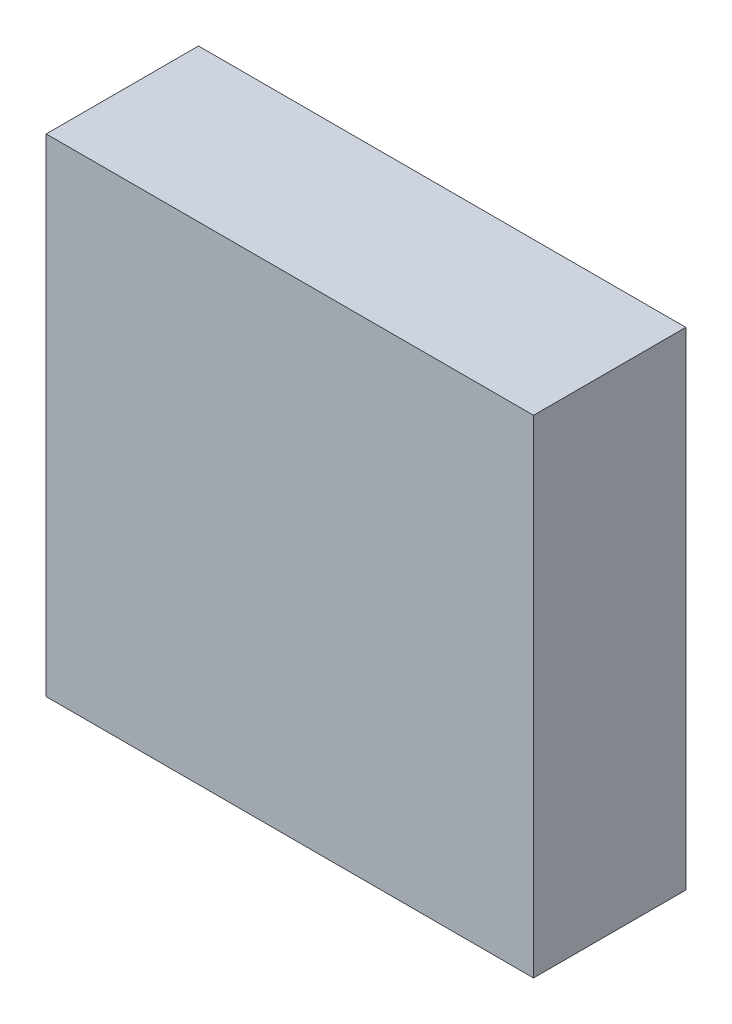
ISO-10303-21;
HEADER;
FILE_DESCRIPTION(('STEP AP214'),'2;1');
FILE_NAME('part.step','',(''),(''),'','','');
FILE_SCHEMA(('AUTOMOTIVE_DESIGN { 1 0 10303 214 1 1 1 1 }'));
ENDSEC;
DATA;
#1=APPLICATION_CONTEXT('core data for automotive mechanical design processes');
#2=APPLICATION_PROTOCOL_DEFINITION('international standard','automotive_design',2000,#1);
#3=PRODUCT_CONTEXT('',#1,'mechanical');
#4=PRODUCT('Part','Part','',(#3));
#5=PRODUCT_RELATED_PRODUCT_CATEGORY('part','',(#4));
#6=PRODUCT_DEFINITION_FORMATION('','',#4);
#7=PRODUCT_DEFINITION_CONTEXT('part definition',#1,'design');
#8=PRODUCT_DEFINITION('design','',#6,#7);
#9=PRODUCT_DEFINITION_SHAPE('','',#8);
#10=(LENGTH_UNIT() NAMED_UNIT(*) SI_UNIT(.MILLI.,.METRE.));
#11=(NAMED_UNIT(*) PLANE_ANGLE_UNIT() SI_UNIT($,.RADIAN.));
#12=(NAMED_UNIT(*) SI_UNIT($,.STERADIAN.) SOLID_ANGLE_UNIT());
#13=UNCERTAINTY_MEASURE_WITH_UNIT(LENGTH_MEASURE(1.E-05),#10,'distance_accuracy_value','');
#14=(GEOMETRIC_REPRESENTATION_CONTEXT(3) GLOBAL_UNCERTAINTY_ASSIGNED_CONTEXT((#13)) GLOBAL_UNIT_ASSIGNED_CONTEXT((#10,
#11,#12)) REPRESENTATION_CONTEXT('',''));
#15=CARTESIAN_POINT('',(0.,0.,0.));
#16=DIRECTION('',(0.,0.,1.));
#17=DIRECTION('',(1.,0.,0.));
#18=AXIS2_PLACEMENT_3D('',#15,#16,#17);
#19=CARTESIAN_POINT('',(-34.6273456639864,47.6367500140435,25.));
#20=DIRECTION('',(1.,0.,0.));
#21=DIRECTION('',(0.,0.,-1.));
#22=AXIS2_PLACEMENT_3D('',#19,#20,#21);
#23=PLANE('',#22);
#24=DIRECTION('',(0.,-1.,0.));
#25=VECTOR('',#24,1.);
#26=CARTESIAN_POINT('',(-34.6273456639864,47.6367500140435,0.));
#27=LINE('',#26,#25);
#28=CARTESIAN_POINT('',(-34.6273456639864,47.6367500140435,0.));
#29=VERTEX_POINT('',#28);
#30=CARTESIAN_POINT('',(-34.6273456639864,-32.3632499859565,0.));
#31=VERTEX_POINT('',#30);
#32=EDGE_CURVE('E94',#29,#31,#27,.T.);
#33=ORIENTED_EDGE('',*,*,#32,.T.);
#34=DIRECTION('',(0.,0.,-1.));
#35=VECTOR('',#34,1.);
#36=CARTESIAN_POINT('',(-34.6273456639864,-32.3632499859565,25.));
#37=LINE('',#36,#35);
#38=CARTESIAN_POINT('',(-34.6273456639864,-32.3632499859565,25.));
#39=VERTEX_POINT('',#38);
#40=EDGE_CURVE('E11',#39,#31,#37,.T.);
#41=ORIENTED_EDGE('',*,*,#40,.F.);
#42=DIRECTION('',(0.,-1.,0.));
#43=VECTOR('',#42,1.);
#44=CARTESIAN_POINT('',(-34.6273456639864,47.6367500140435,25.));
#45=LINE('',#44,#43);
#46=CARTESIAN_POINT('',(-34.6273456639864,47.6367500140435,25.));
#47=VERTEX_POINT('',#46);
#48=EDGE_CURVE('E82',#47,#39,#45,.T.);
#49=ORIENTED_EDGE('',*,*,#48,.F.);
#50=DIRECTION('',(0.,0.,-1.));
#51=VECTOR('',#50,1.);
#52=CARTESIAN_POINT('',(-34.6273456639864,47.6367500140435,25.));
#53=LINE('',#52,#51);
#54=EDGE_CURVE('E90',#47,#29,#53,.T.);
#55=ORIENTED_EDGE('',*,*,#54,.T.);
#56=EDGE_LOOP('',(#33,#41,#49,#55));
#57=FACE_BOUND('',#56,.T.);
#58=ADVANCED_FACE('F31',(#57),#23,.F.);
#59=CARTESIAN_POINT('',(-34.6273456639864,-32.3632499859565,25.));
#60=DIRECTION('',(0.,1.,0.));
#61=DIRECTION('',(0.,0.,1.));
#62=AXIS2_PLACEMENT_3D('',#59,#60,#61);
#63=PLANE('',#62);
#64=DIRECTION('',(1.,0.,0.));
#65=VECTOR('',#64,1.);
#66=CARTESIAN_POINT('',(-34.6273456639864,-32.3632499859565,0.));
#67=LINE('',#66,#65);
#68=CARTESIAN_POINT('',(45.3726543360136,-32.3632499859565,0.));
#69=VERTEX_POINT('',#68);
#70=EDGE_CURVE('E86',#31,#69,#67,.T.);
#71=ORIENTED_EDGE('',*,*,#70,.T.);
#72=DIRECTION('',(0.,0.,-1.));
#73=VECTOR('',#72,1.);
#74=CARTESIAN_POINT('',(45.3726543360136,-32.3632499859565,25.));
#75=LINE('',#74,#73);
#76=CARTESIAN_POINT('',(45.3726543360136,-32.3632499859565,25.));
#77=VERTEX_POINT('',#76);
#78=EDGE_CURVE('E39',#77,#69,#75,.T.);
#79=ORIENTED_EDGE('',*,*,#78,.F.);
#80=DIRECTION('',(1.,0.,0.));
#81=VECTOR('',#80,1.);
#82=CARTESIAN_POINT('',(-34.6273456639864,-32.3632499859565,25.));
#83=LINE('',#82,#81);
#84=EDGE_CURVE('E77',#39,#77,#83,.T.);
#85=ORIENTED_EDGE('',*,*,#84,.F.);
#86=ORIENTED_EDGE('',*,*,#40,.T.);
#87=EDGE_LOOP('',(#71,#79,#85,#86));
#88=FACE_BOUND('',#87,.T.);
#89=ADVANCED_FACE('F85',(#88),#63,.F.);
#90=CARTESIAN_POINT('',(45.3726543360136,47.6367500140435,25.));
#91=DIRECTION('',(-1.,0.,0.));
#92=DIRECTION('',(0.,-1.,0.));
#93=AXIS2_PLACEMENT_3D('',#90,#91,#92);
#94=PLANE('',#93);
#95=DIRECTION('',(0.,1.,0.));
#96=VECTOR('',#95,1.);
#97=CARTESIAN_POINT('',(45.3726543360136,47.6367500140435,0.));
#98=LINE('',#97,#96);
#99=CARTESIAN_POINT('',(45.3726543360136,47.6367500140435,0.));
#100=VERTEX_POINT('',#99);
#101=EDGE_CURVE('E64',#69,#100,#98,.T.);
#102=ORIENTED_EDGE('',*,*,#101,.T.);
#103=DIRECTION('',(0.,0.,-1.));
#104=VECTOR('',#103,1.);
#105=CARTESIAN_POINT('',(45.3726543360136,47.6367500140435,25.));
#106=LINE('',#105,#104);
#107=CARTESIAN_POINT('',(45.3726543360136,47.6367500140435,25.));
#108=VERTEX_POINT('',#107);
#109=EDGE_CURVE('E87',#108,#100,#106,.T.);
#110=ORIENTED_EDGE('',*,*,#109,.F.);
#111=DIRECTION('',(0.,1.,0.));
#112=VECTOR('',#111,1.);
#113=CARTESIAN_POINT('',(45.3726543360136,47.6367500140435,25.));
#114=LINE('',#113,#112);
#115=EDGE_CURVE('E80',#77,#108,#114,.T.);
#116=ORIENTED_EDGE('',*,*,#115,.F.);
#117=ORIENTED_EDGE('',*,*,#78,.T.);
#118=EDGE_LOOP('',(#102,#110,#116,#117));
#119=FACE_BOUND('',#118,.T.);
#120=ADVANCED_FACE('F88',(#119),#94,.F.);
#121=CARTESIAN_POINT('',(-34.6273456639864,47.6367500140435,25.));
#122=DIRECTION('',(0.,-1.,0.));
#123=DIRECTION('',(0.,0.,-1.));
#124=AXIS2_PLACEMENT_3D('',#121,#122,#123);
#125=PLANE('',#124);
#126=DIRECTION('',(-1.,0.,0.));
#127=VECTOR('',#126,1.);
#128=CARTESIAN_POINT('',(-34.6273456639864,47.6367500140435,0.));
#129=LINE('',#128,#127);
#130=EDGE_CURVE('E70',#100,#29,#129,.T.);
#131=ORIENTED_EDGE('',*,*,#130,.T.);
#132=ORIENTED_EDGE('',*,*,#54,.F.);
#133=DIRECTION('',(-1.,0.,0.));
#134=VECTOR('',#133,1.);
#135=CARTESIAN_POINT('',(-34.6273456639864,47.6367500140435,25.));
#136=LINE('',#135,#134);
#137=EDGE_CURVE('E47',#108,#47,#136,.T.);
#138=ORIENTED_EDGE('',*,*,#137,.F.);
#139=ORIENTED_EDGE('',*,*,#109,.T.);
#140=EDGE_LOOP('',(#131,#132,#138,#139));
#141=FACE_BOUND('',#140,.T.);
#142=ADVANCED_FACE('F101',(#141),#125,.F.);
#143=CARTESIAN_POINT('',(-34.6273456639864,-32.3632499859565,25.));
#144=DIRECTION('',(0.,0.,1.));
#145=DIRECTION('',(1.,0.,0.));
#146=AXIS2_PLACEMENT_3D('',#143,#144,#145);
#147=PLANE('',#146);
#148=ORIENTED_EDGE('',*,*,#48,.T.);
#149=ORIENTED_EDGE('',*,*,#84,.T.);
#150=ORIENTED_EDGE('',*,*,#115,.T.);
#151=ORIENTED_EDGE('',*,*,#137,.T.);
#152=EDGE_LOOP('',(#148,#149,#150,#151));
#153=FACE_BOUND('',#152,.T.);
#154=ADVANCED_FACE('F78',(#153),#147,.T.);
#155=CARTESIAN_POINT('',(-34.6273456639864,-32.3632499859565,0.));
#156=DIRECTION('',(0.,0.,1.));
#157=DIRECTION('',(1.,0.,0.));
#158=AXIS2_PLACEMENT_3D('',#155,#156,#157);
#159=PLANE('',#158);
#160=ORIENTED_EDGE('',*,*,#32,.F.);
#161=ORIENTED_EDGE('',*,*,#130,.F.);
#162=ORIENTED_EDGE('',*,*,#101,.F.);
#163=ORIENTED_EDGE('',*,*,#70,.F.);
#164=EDGE_LOOP('',(#160,#161,#162,#163));
#165=FACE_BOUND('',#164,.T.);
#166=ADVANCED_FACE('F104',(#165),#159,.F.);
#167=CLOSED_SHELL('',(#58,#89,#120,#142,#154,#166));
#168=MANIFOLD_SOLID_BREP('B2',#167);
#169=ADVANCED_BREP_SHAPE_REPRESENTATION('',(#18,#168),#14);
#170=SHAPE_DEFINITION_REPRESENTATION(#9,#169);
ENDSEC;
END-ISO-10303-21;
